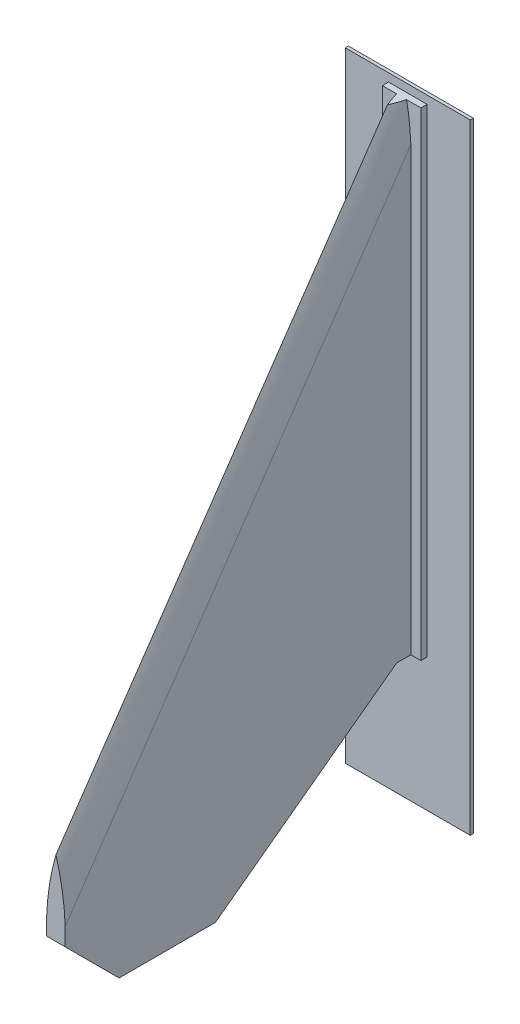
ISO-10303-21;
HEADER;
FILE_DESCRIPTION(('STEP AP214'),'2;1');
FILE_NAME('part.step','',(''),(''),'','','');
FILE_SCHEMA(('AUTOMOTIVE_DESIGN { 1 0 10303 214 1 1 1 1 }'));
ENDSEC;
DATA;
#1=APPLICATION_CONTEXT('core data for automotive mechanical design processes');
#2=APPLICATION_PROTOCOL_DEFINITION('international standard','automotive_design',2000,#1);
#3=PRODUCT_CONTEXT('',#1,'mechanical');
#4=PRODUCT('Part','Part','',(#3));
#5=PRODUCT_RELATED_PRODUCT_CATEGORY('part','',(#4));
#6=PRODUCT_DEFINITION_FORMATION('','',#4);
#7=PRODUCT_DEFINITION_CONTEXT('part definition',#1,'design');
#8=PRODUCT_DEFINITION('design','',#6,#7);
#9=PRODUCT_DEFINITION_SHAPE('','',#8);
#10=(LENGTH_UNIT() NAMED_UNIT(*) SI_UNIT(.MILLI.,.METRE.));
#11=(NAMED_UNIT(*) PLANE_ANGLE_UNIT() SI_UNIT($,.RADIAN.));
#12=(NAMED_UNIT(*) SI_UNIT($,.STERADIAN.) SOLID_ANGLE_UNIT());
#13=UNCERTAINTY_MEASURE_WITH_UNIT(LENGTH_MEASURE(1.E-05),#10,'distance_accuracy_value','');
#14=(GEOMETRIC_REPRESENTATION_CONTEXT(3) GLOBAL_UNCERTAINTY_ASSIGNED_CONTEXT((#13)) GLOBAL_UNIT_ASSIGNED_CONTEXT((#10,
#11,#12)) REPRESENTATION_CONTEXT('',''));
#15=CARTESIAN_POINT('',(0.,0.,0.));
#16=DIRECTION('',(0.,0.,1.));
#17=DIRECTION('',(1.,0.,0.));
#18=AXIS2_PLACEMENT_3D('',#15,#16,#17);
#19=CARTESIAN_POINT('',(-1.524,0.,0.));
#20=DIRECTION('',(0.,-1.,0.));
#21=DIRECTION('',(0.,0.,-1.));
#22=AXIS2_PLACEMENT_3D('',#19,#20,#21);
#23=PLANE('',#22);
#24=DIRECTION('',(0.,0.,-1.));
#25=VECTOR('',#24,1.);
#26=CARTESIAN_POINT('',(-1.524,0.,0.));
#27=LINE('',#26,#25);
#28=CARTESIAN_POINT('',(-1.524,0.,2.33429532514625));
#29=VERTEX_POINT('',#28);
#30=CARTESIAN_POINT('',(-1.524,0.,0.));
#31=VERTEX_POINT('',#30);
#32=EDGE_CURVE('E300',#29,#31,#27,.T.);
#33=ORIENTED_EDGE('',*,*,#32,.T.);
#34=DIRECTION('',(-1.,0.,0.));
#35=VECTOR('',#34,1.);
#36=CARTESIAN_POINT('',(-3.175,0.,0.));
#37=LINE('',#36,#35);
#38=CARTESIAN_POINT('',(-3.175,0.,0.));
#39=VERTEX_POINT('',#38);
#40=EDGE_CURVE('E214',#31,#39,#37,.T.);
#41=ORIENTED_EDGE('',*,*,#40,.T.);
#42=DIRECTION('',(0.,0.,1.));
#43=VECTOR('',#42,1.);
#44=CARTESIAN_POINT('',(-3.175,0.,-1.016));
#45=LINE('',#44,#43);
#46=CARTESIAN_POINT('',(-3.175,0.,-1.016));
#47=VERTEX_POINT('',#46);
#48=EDGE_CURVE('E201',#47,#39,#45,.T.);
#49=ORIENTED_EDGE('',*,*,#48,.F.);
#50=DIRECTION('',(-1.,0.,0.));
#51=VECTOR('',#50,1.);
#52=CARTESIAN_POINT('',(-3.175,0.,-1.016));
#53=LINE('',#52,#51);
#54=CARTESIAN_POINT('',(3.175,0.,-1.016));
#55=VERTEX_POINT('',#54);
#56=EDGE_CURVE('E199',#55,#47,#53,.T.);
#57=ORIENTED_EDGE('',*,*,#56,.F.);
#58=DIRECTION('',(0.,0.,1.));
#59=VECTOR('',#58,1.);
#60=CARTESIAN_POINT('',(3.175,0.,-1.016));
#61=LINE('',#60,#59);
#62=CARTESIAN_POINT('',(3.175,0.,0.));
#63=VERTEX_POINT('',#62);
#64=EDGE_CURVE('E222',#55,#63,#61,.T.);
#65=ORIENTED_EDGE('',*,*,#64,.T.);
#66=CARTESIAN_POINT('',(1.524,0.,0.));
#67=VERTEX_POINT('',#66);
#68=EDGE_CURVE('E193',#63,#67,#37,.T.);
#69=ORIENTED_EDGE('',*,*,#68,.T.);
#70=DIRECTION('',(0.,0.,-1.));
#71=VECTOR('',#70,1.);
#72=CARTESIAN_POINT('',(1.524,0.,0.));
#73=LINE('',#72,#71);
#74=CARTESIAN_POINT('',(1.524,0.,2.33429532514625));
#75=VERTEX_POINT('',#74);
#76=EDGE_CURVE('E295',#75,#67,#73,.T.);
#77=ORIENTED_EDGE('',*,*,#76,.F.);
#78=DIRECTION('',(1.,0.,0.));
#79=VECTOR('',#78,1.);
#80=CARTESIAN_POINT('',(-1.524,0.,2.33429532514625));
#81=LINE('',#80,#79);
#82=EDGE_CURVE('E309',#29,#75,#81,.T.);
#83=ORIENTED_EDGE('',*,*,#82,.F.);
#84=EDGE_LOOP('',(#33,#41,#49,#57,#65,#69,#77,#83));
#85=FACE_BOUND('',#84,.T.);
#86=ADVANCED_FACE('F33',(#85),#23,.T.);
#87=CARTESIAN_POINT('',(-1.524,0.,2.33429532514625));
#88=DIRECTION('',(0.,-0.803895837324771,-0.594770109144622));
#89=DIRECTION('',(0.,0.594770109144622,-0.803895837324771));
#90=AXIS2_PLACEMENT_3D('',#87,#88,#89);
#91=PLANE('',#90);
#92=ORIENTED_EDGE('',*,*,#82,.T.);
#93=DIRECTION('',(0.,0.594770109144622,-0.803895837324771));
#94=VECTOR('',#93,1.);
#95=CARTESIAN_POINT('',(1.524,0.,2.33429532514625));
#96=LINE('',#95,#94);
#97=CARTESIAN_POINT('',(1.524,-22.0564161918037,32.1459164713298));
#98=VERTEX_POINT('',#97);
#99=EDGE_CURVE('E297',#98,#75,#96,.T.);
#100=ORIENTED_EDGE('',*,*,#99,.F.);
#101=DIRECTION('',(1.,0.,0.));
#102=VECTOR('',#101,1.);
#103=CARTESIAN_POINT('',(-1.524,-22.0564161918037,32.1459164713298));
#104=LINE('',#103,#102);
#105=CARTESIAN_POINT('',(-1.524,-22.0564161918037,32.1459164713298));
#106=VERTEX_POINT('',#105);
#107=EDGE_CURVE('E314',#106,#98,#104,.T.);
#108=ORIENTED_EDGE('',*,*,#107,.F.);
#109=DIRECTION('',(0.,0.594770109144622,-0.803895837324771));
#110=VECTOR('',#109,1.);
#111=CARTESIAN_POINT('',(-1.524,0.,2.33429532514625));
#112=LINE('',#111,#110);
#113=EDGE_CURVE('E303',#106,#29,#112,.T.);
#114=ORIENTED_EDGE('',*,*,#113,.T.);
#115=EDGE_LOOP('',(#92,#100,#108,#114));
#116=FACE_BOUND('',#115,.T.);
#117=ADVANCED_FACE('F350',(#116),#91,.T.);
#118=CARTESIAN_POINT('',(-1.524,-22.0564161918037,32.1459164713298));
#119=DIRECTION('',(0.,-1.,0.));
#120=DIRECTION('',(0.,0.,-1.));
#121=AXIS2_PLACEMENT_3D('',#118,#119,#120);
#122=PLANE('',#121);
#123=ORIENTED_EDGE('',*,*,#107,.T.);
#124=DIRECTION('',(0.,0.,-1.));
#125=VECTOR('',#124,1.);
#126=CARTESIAN_POINT('',(1.524,-22.0564161918037,32.1459164713298));
#127=LINE('',#126,#125);
#128=CARTESIAN_POINT('',(1.524,-22.0564161918037,47.9926333712735));
#129=VERTEX_POINT('',#128);
#130=EDGE_CURVE('E328',#129,#98,#127,.T.);
#131=ORIENTED_EDGE('',*,*,#130,.F.);
#132=DIRECTION('',(1.,0.,0.));
#133=VECTOR('',#132,1.);
#134=CARTESIAN_POINT('',(-1.524,-22.0564161918037,47.9926333712735));
#135=LINE('',#134,#133);
#136=CARTESIAN_POINT('',(-1.524,-22.0564161918037,47.9926333712735));
#137=VERTEX_POINT('',#136);
#138=EDGE_CURVE('E312',#137,#129,#135,.T.);
#139=ORIENTED_EDGE('',*,*,#138,.F.);
#140=DIRECTION('',(0.,0.,-1.));
#141=VECTOR('',#140,1.);
#142=CARTESIAN_POINT('',(-1.524,-22.0564161918037,32.1459164713298));
#143=LINE('',#142,#141);
#144=EDGE_CURVE('E319',#137,#106,#143,.T.);
#145=ORIENTED_EDGE('',*,*,#144,.T.);
#146=EDGE_LOOP('',(#123,#131,#139,#145));
#147=FACE_BOUND('',#146,.T.);
#148=ADVANCED_FACE('F346',(#147),#122,.T.);
#149=CARTESIAN_POINT('',(-1.524,-22.0564161918037,47.9926333712735));
#150=DIRECTION('',(0.,-0.707106781186548,0.707106781186546));
#151=DIRECTION('',(0.,-0.707106781186547,-0.707106781186549));
#152=AXIS2_PLACEMENT_3D('',#149,#150,#151);
#153=PLANE('',#152);
#154=ORIENTED_EDGE('',*,*,#138,.T.);
#155=DIRECTION('',(0.,-0.707106781186546,-0.707106781186548));
#156=VECTOR('',#155,1.);
#157=CARTESIAN_POINT('',(1.524,-22.0564161918037,47.9926333712735));
#158=LINE('',#157,#156);
#159=CARTESIAN_POINT('',(1.524,-13.1863749896723,56.8626745734048));
#160=VERTEX_POINT('',#159);
#161=EDGE_CURVE('E331',#160,#129,#158,.T.);
#162=ORIENTED_EDGE('',*,*,#161,.F.);
#163=DIRECTION('',(1.,0.,0.));
#164=VECTOR('',#163,1.);
#165=CARTESIAN_POINT('',(-1.524,-13.1863749896723,56.8626745734048));
#166=LINE('',#165,#164);
#167=CARTESIAN_POINT('',(-1.524,-13.1863749896723,56.8626745734048));
#168=VERTEX_POINT('',#167);
#169=EDGE_CURVE('E302',#168,#160,#166,.T.);
#170=ORIENTED_EDGE('',*,*,#169,.F.);
#171=DIRECTION('',(0.,-0.707106781186546,-0.707106781186548));
#172=VECTOR('',#171,1.);
#173=CARTESIAN_POINT('',(-1.524,-22.0564161918037,47.9926333712735));
#174=LINE('',#173,#172);
#175=EDGE_CURVE('E322',#168,#137,#174,.T.);
#176=ORIENTED_EDGE('',*,*,#175,.T.);
#177=EDGE_LOOP('',(#154,#162,#170,#176));
#178=FACE_BOUND('',#177,.T.);
#179=ADVANCED_FACE('F343',(#178),#153,.T.);
#180=CARTESIAN_POINT('',(-1.524,-13.1863749896723,56.8626745734048));
#181=DIRECTION('',(0.,0.,1.));
#182=DIRECTION('',(1.,0.,0.));
#183=AXIS2_PLACEMENT_3D('',#180,#181,#182);
#184=PLANE('',#183);
#185=CARTESIAN_POINT('',(37.7850881094343,-11.7611214748783,56.8626745734048));
#186=DIRECTION('',(0.,0.,-1.));
#187=DIRECTION('',(1.,0.,0.));
#188=AXIS2_PLACEMENT_3D('',#185,#186,#187);
#189=CIRCLE('',#188,39.3369767411458);
#190=CARTESIAN_POINT('',(-1.524,-10.2801315565557,56.8626745734048));
#191=VERTEX_POINT('',#190);
#192=CARTESIAN_POINT('',(0.,-0.821064084913292,56.8626745734048));
#193=VERTEX_POINT('',#192);
#194=EDGE_CURVE('E229',#191,#193,#189,.T.);
#195=ORIENTED_EDGE('',*,*,#194,.F.);
#196=DIRECTION('',(0.,-1.,0.));
#197=VECTOR('',#196,1.);
#198=CARTESIAN_POINT('',(-1.524,-13.1863749896723,56.8626745734048));
#199=LINE('',#198,#197);
#200=EDGE_CURVE('E306',#191,#168,#199,.T.);
#201=ORIENTED_EDGE('',*,*,#200,.T.);
#202=ORIENTED_EDGE('',*,*,#169,.T.);
#203=DIRECTION('',(0.,-1.,0.));
#204=VECTOR('',#203,1.);
#205=CARTESIAN_POINT('',(1.524,-13.1863749896723,56.8626745734048));
#206=LINE('',#205,#204);
#207=CARTESIAN_POINT('',(1.524,-10.2801315565556,56.8626745734048));
#208=VERTEX_POINT('',#207);
#209=EDGE_CURVE('E292',#208,#160,#206,.T.);
#210=ORIENTED_EDGE('',*,*,#209,.F.);
#211=CARTESIAN_POINT('',(-37.7850881094343,-11.7611214748784,56.8626745734048));
#212=DIRECTION('',(0.,0.,-1.));
#213=DIRECTION('',(-1.,0.,0.));
#214=AXIS2_PLACEMENT_3D('',#211,#212,#213);
#215=CIRCLE('',#214,39.3369767411458);
#216=EDGE_CURVE('E51',#193,#208,#215,.T.);
#217=ORIENTED_EDGE('',*,*,#216,.F.);
#218=EDGE_LOOP('',(#195,#201,#202,#210,#217));
#219=FACE_BOUND('',#218,.T.);
#220=ADVANCED_FACE('F339',(#219),#184,.T.);
#221=CARTESIAN_POINT('',(-1.524,78.74,2.33429532514624));
#222=DIRECTION('',(0.,1.,0.));
#223=DIRECTION('',(0.,0.,1.));
#224=AXIS2_PLACEMENT_3D('',#221,#222,#223);
#225=PLANE('',#224);
#226=CARTESIAN_POINT('',(-1.524,78.74,-4.14861970824375));
#227=CARTESIAN_POINT('',(-1.51371825896039,78.74,-3.96153898447371));
#228=CARTESIAN_POINT('',(-1.50059326464043,78.74,-3.77461545036038));
#229=CARTESIAN_POINT('',(-1.46876603893261,78.74,-3.4020449218006));
#230=CARTESIAN_POINT('',(-1.45008777763733,78.74,-3.21639588000607));
#231=CARTESIAN_POINT('',(-1.40724682935353,78.74,-2.84636210265337));
#232=CARTESIAN_POINT('',(-1.38310271699735,78.74,-2.66197521514452));
#233=CARTESIAN_POINT('',(-1.32941762028496,78.74,-2.29445358205488));
#234=CARTESIAN_POINT('',(-1.29989009187821,78.74,-2.11131686995024));
#235=CARTESIAN_POINT('',(-1.23551653249375,78.74,-1.74628454362839));
#236=CARTESIAN_POINT('',(-1.2006791258625,78.74,-1.56438740775629));
#237=CARTESIAN_POINT('',(-1.125756565645,78.74,-1.20182398286551));
#238=CARTESIAN_POINT('',(-1.08567548204195,78.74,-1.02115685240642));
#239=CARTESIAN_POINT('',(-1.00034139438253,78.74,-0.661097416207776));
#240=CARTESIAN_POINT('',(-0.955089712415739,78.74,-0.481704796989204));
#241=CARTESIAN_POINT('',(-0.859457466656503,78.74,-0.124119290485601));
#242=CARTESIAN_POINT('',(-0.809072319003657,78.74,0.0540723703687956));
#243=CARTESIAN_POINT('',(-0.703218819175915,78.74,0.40927089597473));
#244=CARTESIAN_POINT('',(-0.647741913574638,78.74,0.586275210576693));
#245=CARTESIAN_POINT('',(-0.531743442778314,78.74,0.939112031509249));
#246=CARTESIAN_POINT('',(-0.471209633499148,78.74,1.11494051102723));
#247=CARTESIAN_POINT('',(-0.345128732447443,78.74,1.46543600537005));
#248=CARTESIAN_POINT('',(-0.279565969904735,78.74,1.64009737976876));
#249=CARTESIAN_POINT('',(-0.143452981918217,78.74,1.98826933671841));
#250=CARTESIAN_POINT('',(-0.072883913870658,78.74,2.16177255473749));
#251=CARTESIAN_POINT('',(0.,78.74,2.33429532514619));
#252=B_SPLINE_CURVE_WITH_KNOTS('',3,(#226,#227,#228,#229,#230,#231,#232,#233,#234,#235,#236,
#237,#238,#239,#240,#241,#242,#243,#244,#245,#246,#247,#248,#249,#250,#251),.UNSPECIFIED.,.F.,
.F.,(4,2,2,2,2,2,2,2,2,2,2,2,4),(0.,0.562066140985756,1.12174056007582,1.67954084913324,
2.23596555828684,2.79149596347554,3.34659771295482,3.90155784268212,4.45701793356774,
5.01342882013831,5.57122830239176,6.13084268449768,6.6926882223112),.UNSPECIFIED.);
#253=CARTESIAN_POINT('',(-0.823647122904773,78.74,0.));
#254=VERTEX_POINT('',#253);
#255=CARTESIAN_POINT('',(0.,78.74,2.33429532514619));
#256=VERTEX_POINT('',#255);
#257=EDGE_CURVE('E242',#254,#256,#252,.T.);
#258=ORIENTED_EDGE('',*,*,#257,.T.);
#259=CARTESIAN_POINT('',(0.,78.74,2.33429532514619));
#260=CARTESIAN_POINT('',(0.072883913870665,78.74,2.16177255473749));
#261=CARTESIAN_POINT('',(0.143452981918225,78.74,1.98826933671841));
#262=CARTESIAN_POINT('',(0.279565969904741,78.74,1.64009737976876));
#263=CARTESIAN_POINT('',(0.345128732447446,78.74,1.46543600537005));
#264=CARTESIAN_POINT('',(0.47120963349915,78.74,1.11494051102723));
#265=CARTESIAN_POINT('',(0.531743442778318,78.74,0.939112031509251));
#266=CARTESIAN_POINT('',(0.647741913574645,78.74,0.586275210576697));
#267=CARTESIAN_POINT('',(0.703218819175922,78.74,0.409270895974734));
#268=CARTESIAN_POINT('',(0.809072319003663,78.74,0.0540723703687982));
#269=CARTESIAN_POINT('',(0.859457466656507,78.74,-0.124119290485599));
#270=CARTESIAN_POINT('',(0.955089712415742,78.74,-0.481704796989202));
#271=CARTESIAN_POINT('',(1.00034139438253,78.74,-0.661097416207774));
#272=CARTESIAN_POINT('',(1.08567548204196,78.74,-1.02115685240642));
#273=CARTESIAN_POINT('',(1.125756565645,78.74,-1.20182398286551));
#274=CARTESIAN_POINT('',(1.20067912586251,78.74,-1.56438740775629));
#275=CARTESIAN_POINT('',(1.23551653249376,78.74,-1.74628454362839));
#276=CARTESIAN_POINT('',(1.29989009187822,78.74,-2.11131686995024));
#277=CARTESIAN_POINT('',(1.32941762028497,78.74,-2.29445358205488));
#278=CARTESIAN_POINT('',(1.38310271699735,78.74,-2.66197521514452));
#279=CARTESIAN_POINT('',(1.40724682935353,78.74,-2.84636210265337));
#280=CARTESIAN_POINT('',(1.45008777763733,78.74,-3.21639588000607));
#281=CARTESIAN_POINT('',(1.46876603893261,78.74,-3.4020449218006));
#282=CARTESIAN_POINT('',(1.50059326464044,78.74,-3.77461545036038));
#283=CARTESIAN_POINT('',(1.5137182589604,78.74,-3.96153898447371));
#284=CARTESIAN_POINT('',(1.524,78.74,-4.14861970824375));
#285=B_SPLINE_CURVE_WITH_KNOTS('',3,(#259,#260,#261,#262,#263,#264,#265,#266,#267,#268,#269,
#270,#271,#272,#273,#274,#275,#276,#277,#278,#279,#280,#281,#282,#283,#284),.UNSPECIFIED.,.F.,
.F.,(4,2,2,2,2,2,2,2,2,2,2,2,4),(0.,0.561845537813521,1.12145991991945,1.6792594021729,
2.23567028874347,2.79113037962909,3.34609050935639,3.90119225883566,4.45672266402436,
5.01314737317796,5.57094766223539,6.13062208132545,6.69268822231121),.UNSPECIFIED.);
#286=CARTESIAN_POINT('',(0.823647122904773,78.74,0.));
#287=VERTEX_POINT('',#286);
#288=EDGE_CURVE('E279',#256,#287,#285,.T.);
#289=ORIENTED_EDGE('',*,*,#288,.T.);
#290=DIRECTION('',(1.,0.,0.));
#291=VECTOR('',#290,1.);
#292=CARTESIAN_POINT('',(-3.175,78.74,0.));
#293=LINE('',#292,#291);
#294=CARTESIAN_POINT('',(3.175,78.74,0.));
#295=VERTEX_POINT('',#294);
#296=EDGE_CURVE('E183',#287,#295,#293,.T.);
#297=ORIENTED_EDGE('',*,*,#296,.T.);
#298=DIRECTION('',(0.,0.,1.));
#299=VECTOR('',#298,1.);
#300=CARTESIAN_POINT('',(3.175,78.74,-1.016));
#301=LINE('',#300,#299);
#302=CARTESIAN_POINT('',(3.175,78.74,-1.016));
#303=VERTEX_POINT('',#302);
#304=EDGE_CURVE('E225',#303,#295,#301,.T.);
#305=ORIENTED_EDGE('',*,*,#304,.F.);
#306=DIRECTION('',(1.,0.,0.));
#307=VECTOR('',#306,1.);
#308=CARTESIAN_POINT('',(-3.175,78.74,-1.016));
#309=LINE('',#308,#307);
#310=CARTESIAN_POINT('',(-3.175,78.74,-1.016));
#311=VERTEX_POINT('',#310);
#312=EDGE_CURVE('E192',#311,#303,#309,.T.);
#313=ORIENTED_EDGE('',*,*,#312,.F.);
#314=DIRECTION('',(0.,0.,1.));
#315=VECTOR('',#314,1.);
#316=CARTESIAN_POINT('',(-3.175,78.74,-1.016));
#317=LINE('',#316,#315);
#318=CARTESIAN_POINT('',(-3.175,78.74,0.));
#319=VERTEX_POINT('',#318);
#320=EDGE_CURVE('E227',#311,#319,#317,.T.);
#321=ORIENTED_EDGE('',*,*,#320,.T.);
#322=EDGE_CURVE('E211',#319,#254,#293,.T.);
#323=ORIENTED_EDGE('',*,*,#322,.T.);
#324=EDGE_LOOP('',(#258,#289,#297,#305,#313,#321,#323));
#325=FACE_BOUND('',#324,.T.);
#326=ADVANCED_FACE('F364',(#325),#225,.T.);
#327=CARTESIAN_POINT('',(-1.524,0.,0.));
#328=DIRECTION('',(-1.,0.,0.));
#329=DIRECTION('',(0.,0.,1.));
#330=AXIS2_PLACEMENT_3D('',#327,#328,#329);
#331=PLANE('',#330);
#332=DIRECTION('',(0.,-0.824863155549333,0.565332446103349));
#333=VECTOR('',#332,1.);
#334=CARTESIAN_POINT('',(-1.524,23.2307727461169,33.8954691974434));
#335=LINE('',#334,#333);
#336=CARTESIAN_POINT('',(-1.524,72.6868474394083,0.));
#337=VERTEX_POINT('',#336);
#338=EDGE_CURVE('E11',#337,#191,#335,.T.);
#339=ORIENTED_EDGE('',*,*,#338,.F.);
#340=DIRECTION('',(0.,1.,0.));
#341=VECTOR('',#340,1.);
#342=CARTESIAN_POINT('',(-1.524,78.74,0.));
#343=LINE('',#342,#341);
#344=EDGE_CURVE('E59',#31,#337,#343,.T.);
#345=ORIENTED_EDGE('',*,*,#344,.F.);
#346=ORIENTED_EDGE('',*,*,#32,.F.);
#347=ORIENTED_EDGE('',*,*,#113,.F.);
#348=ORIENTED_EDGE('',*,*,#144,.F.);
#349=ORIENTED_EDGE('',*,*,#175,.F.);
#350=ORIENTED_EDGE('',*,*,#200,.F.);
#351=EDGE_LOOP('',(#339,#345,#346,#347,#348,#349,#350));
#352=FACE_BOUND('',#351,.T.);
#353=ADVANCED_FACE('F348',(#352),#331,.T.);
#354=CARTESIAN_POINT('',(1.524,0.,0.));
#355=DIRECTION('',(-1.,0.,0.));
#356=DIRECTION('',(0.,0.,1.));
#357=AXIS2_PLACEMENT_3D('',#354,#355,#356);
#358=PLANE('',#357);
#359=DIRECTION('',(0.,1.,0.));
#360=VECTOR('',#359,1.);
#361=CARTESIAN_POINT('',(1.524,78.74,0.));
#362=LINE('',#361,#360);
#363=CARTESIAN_POINT('',(1.524,72.6868474394084,0.));
#364=VERTEX_POINT('',#363);
#365=EDGE_CURVE('E289',#67,#364,#362,.T.);
#366=ORIENTED_EDGE('',*,*,#365,.T.);
#367=DIRECTION('',(0.,-0.824863155549333,0.565332446103349));
#368=VECTOR('',#367,1.);
#369=CARTESIAN_POINT('',(1.524,34.496994616392,26.1739935497356));
#370=LINE('',#369,#368);
#371=EDGE_CURVE('E43',#364,#208,#370,.T.);
#372=ORIENTED_EDGE('',*,*,#371,.T.);
#373=ORIENTED_EDGE('',*,*,#209,.T.);
#374=ORIENTED_EDGE('',*,*,#161,.T.);
#375=ORIENTED_EDGE('',*,*,#130,.T.);
#376=ORIENTED_EDGE('',*,*,#99,.T.);
#377=ORIENTED_EDGE('',*,*,#76,.T.);
#378=EDGE_LOOP('',(#366,#372,#373,#374,#375,#376,#377));
#379=FACE_BOUND('',#378,.T.);
#380=ADVANCED_FACE('F257',(#379),#358,.F.);
#381=CARTESIAN_POINT('',(37.7850881094343,84.8934028820467,-9.38096634333169));
#382=DIRECTION('',(0.,0.,-1.));
#383=DIRECTION('',(1.,0.,0.));
#384=AXIS2_PLACEMENT_3D('',#381,#382,#383);
#385=CIRCLE('',#384,39.3369767411458);
#386=DIRECTION('',(0.,-0.824863155549333,0.565332446103349));
#387=VECTOR('',#386,1.);
#388=SURFACE_OF_LINEAR_EXTRUSION('',#385,#387);
#389=CARTESIAN_POINT('',(-0.823647122904773,78.74,0.));
#390=CARTESIAN_POINT('',(-0.862645211680702,78.5401548936583,0.));
#391=CARTESIAN_POINT('',(-0.900091388966516,78.3400069522008,0.));
#392=CARTESIAN_POINT('',(-0.971837007552554,77.9393462925565,0.));
#393=CARTESIAN_POINT('',(-1.00613943701135,77.7388341094509,0.));
#394=CARTESIAN_POINT('',(-1.07160601617764,77.3374463245863,0.));
#395=CARTESIAN_POINT('',(-1.10277240821865,77.1365710885514,0.));
#396=CARTESIAN_POINT('',(-1.16197331124137,76.7344582174829,0.));
#397=CARTESIAN_POINT('',(-1.19000931934349,76.5332208028612,0.));
#398=CARTESIAN_POINT('',(-1.24295355572443,76.1303842127803,0.));
#399=CARTESIAN_POINT('',(-1.26786253513111,75.9287851360404,0.));
#400=CARTESIAN_POINT('',(-1.31455461462513,75.5252253167093,0.));
#401=CARTESIAN_POINT('',(-1.33633771471247,75.323264574118,0.));
#402=CARTESIAN_POINT('',(-1.37677767123561,74.9189812324003,0.));
#403=CARTESIAN_POINT('',(-1.39543377384597,74.7166585578695,0.));
#404=CARTESIAN_POINT('',(-1.42961710495397,74.3116511408115,0.));
#405=CARTESIAN_POINT('',(-1.44514282555466,74.1089662710141,0.));
#406=CARTESIAN_POINT('',(-1.47306044758261,73.7032340524184,0.));
#407=CARTESIAN_POINT('',(-1.48545008240681,73.5001865476579,0.));
#408=CARTESIAN_POINT('',(-1.50708851953441,73.0937284612437,0.));
#409=CARTESIAN_POINT('',(-1.51633429044231,72.8903177182056,0.));
#410=CARTESIAN_POINT('',(-1.524,72.6868474394083,0.));
#411=B_SPLINE_CURVE_WITH_KNOTS('',3,(#389,#390,#391,#392,#393,#394,#395,#396,#397,#398,#399,
#400,#401,#402,#403,#404,#405,#406,#407,#408,#409,#410),.UNSPECIFIED.,.F.,.F.,(4,2,2,2,2,2,2,2,
2,2,4),(0.,0.610837738973069,1.22108871564991,1.83090020207904,2.44041878274993,
3.04979067273565,3.65916256272137,4.26868114339226,4.87849262982137,5.48874360649824,
6.0995813454712),.UNSPECIFIED.);
#412=EDGE_CURVE('E37',#254,#337,#411,.T.);
#413=ORIENTED_EDGE('',*,*,#412,.T.);
#414=ORIENTED_EDGE('',*,*,#338,.T.);
#415=ORIENTED_EDGE('',*,*,#194,.T.);
#416=DIRECTION('',(0.,-0.824863155549333,0.565332446103349));
#417=VECTOR('',#416,1.);
#418=CARTESIAN_POINT('',(0.,95.8334602720117,-9.38096634333169));
#419=LINE('',#418,#417);
#420=EDGE_CURVE('E237',#256,#193,#419,.T.);
#421=ORIENTED_EDGE('',*,*,#420,.F.);
#422=ORIENTED_EDGE('',*,*,#257,.F.);
#423=EDGE_LOOP('',(#413,#414,#415,#421,#422));
#424=FACE_BOUND('',#423,.T.);
#425=ADVANCED_FACE('F251',(#424),#388,.F.);
#426=CARTESIAN_POINT('',(-37.7850881094343,84.8934028820467,-9.38096634333169));
#427=DIRECTION('',(0.,0.,-1.));
#428=DIRECTION('',(-1.,0.,0.));
#429=AXIS2_PLACEMENT_3D('',#426,#427,#428);
#430=CIRCLE('',#429,39.3369767411458);
#431=DIRECTION('',(0.,-0.824863155549333,0.565332446103349));
#432=VECTOR('',#431,1.);
#433=SURFACE_OF_LINEAR_EXTRUSION('',#430,#432);
#434=CARTESIAN_POINT('',(1.524,72.6868474394084,0.));
#435=CARTESIAN_POINT('',(1.51633429044232,72.8903177182057,0.));
#436=CARTESIAN_POINT('',(1.50708851953441,73.0937284612438,0.));
#437=CARTESIAN_POINT('',(1.48545008240681,73.500186547658,0.));
#438=CARTESIAN_POINT('',(1.4730604475826,73.7032340524185,0.));
#439=CARTESIAN_POINT('',(1.44514282555465,74.1089662710142,0.));
#440=CARTESIAN_POINT('',(1.42961710495397,74.3116511408115,0.));
#441=CARTESIAN_POINT('',(1.39543377384597,74.7166585578696,0.));
#442=CARTESIAN_POINT('',(1.3767776712356,74.9189812324004,0.));
#443=CARTESIAN_POINT('',(1.33633771471247,75.323264574118,0.));
#444=CARTESIAN_POINT('',(1.31455461462513,75.5252253167093,0.));
#445=CARTESIAN_POINT('',(1.26786253513111,75.9287851360405,0.));
#446=CARTESIAN_POINT('',(1.24295355572442,76.1303842127803,0.));
#447=CARTESIAN_POINT('',(1.1900093193435,76.5332208028613,0.));
#448=CARTESIAN_POINT('',(1.16197331124138,76.7344582174829,0.));
#449=CARTESIAN_POINT('',(1.10277240821866,77.1365710885514,0.));
#450=CARTESIAN_POINT('',(1.07160601617764,77.3374463245864,0.));
#451=CARTESIAN_POINT('',(1.00613943701135,77.7388341094509,0.));
#452=CARTESIAN_POINT('',(0.971837007552557,77.9393462925565,0.));
#453=CARTESIAN_POINT('',(0.900091388966528,78.3400069522008,0.));
#454=CARTESIAN_POINT('',(0.862645211680718,78.5401548936583,0.));
#455=CARTESIAN_POINT('',(0.82364712290478,78.74,0.));
#456=B_SPLINE_CURVE_WITH_KNOTS('',3,(#434,#435,#436,#437,#438,#439,#440,#441,#442,#443,#444,
#445,#446,#447,#448,#449,#450,#451,#452,#453,#454,#455),.UNSPECIFIED.,.F.,.F.,(4,2,2,2,2,2,2,2,
2,2,4),(0.,0.610837738972964,1.22108871564982,1.83090020207893,2.44041878274981,
3.04979067273551,3.6591625627212,4.26868114339208,4.87849262982119,5.48874360649805,
6.09958134547109),.UNSPECIFIED.);
#457=EDGE_CURVE('E282',#364,#287,#456,.T.);
#458=ORIENTED_EDGE('',*,*,#457,.T.);
#459=ORIENTED_EDGE('',*,*,#288,.F.);
#460=ORIENTED_EDGE('',*,*,#420,.T.);
#461=ORIENTED_EDGE('',*,*,#216,.T.);
#462=ORIENTED_EDGE('',*,*,#371,.F.);
#463=EDGE_LOOP('',(#458,#459,#460,#461,#462));
#464=FACE_BOUND('',#463,.T.);
#465=ADVANCED_FACE('F256',(#464),#433,.F.);
#466=CARTESIAN_POINT('',(-3.175,78.74,0.));
#467=DIRECTION('',(0.,0.,-1.));
#468=DIRECTION('',(-1.,0.,0.));
#469=AXIS2_PLACEMENT_3D('',#466,#467,#468);
#470=PLANE('',#469);
#471=ORIENTED_EDGE('',*,*,#457,.F.);
#472=ORIENTED_EDGE('',*,*,#365,.F.);
#473=ORIENTED_EDGE('',*,*,#68,.F.);
#474=DIRECTION('',(0.,-1.,0.));
#475=VECTOR('',#474,1.);
#476=CARTESIAN_POINT('',(3.175,0.,0.));
#477=LINE('',#476,#475);
#478=EDGE_CURVE('E205',#295,#63,#477,.T.);
#479=ORIENTED_EDGE('',*,*,#478,.F.);
#480=ORIENTED_EDGE('',*,*,#296,.F.);
#481=EDGE_LOOP('',(#471,#472,#473,#479,#480));
#482=FACE_BOUND('',#481,.T.);
#483=ADVANCED_FACE('F361',(#482),#470,.F.);
#484=CARTESIAN_POINT('',(-3.175,0.,-1.016));
#485=DIRECTION('',(1.,0.,0.));
#486=DIRECTION('',(0.,0.,-1.));
#487=AXIS2_PLACEMENT_3D('',#484,#485,#486);
#488=PLANE('',#487);
#489=DIRECTION('',(0.,1.,0.));
#490=VECTOR('',#489,1.);
#491=CARTESIAN_POINT('',(-3.175,0.,0.));
#492=LINE('',#491,#490);
#493=EDGE_CURVE('E180',#39,#319,#492,.T.);
#494=ORIENTED_EDGE('',*,*,#493,.T.);
#495=ORIENTED_EDGE('',*,*,#320,.F.);
#496=DIRECTION('',(0.,1.,0.));
#497=VECTOR('',#496,1.);
#498=CARTESIAN_POINT('',(-3.175,0.,-1.016));
#499=LINE('',#498,#497);
#500=EDGE_CURVE('E189',#47,#311,#499,.T.);
#501=ORIENTED_EDGE('',*,*,#500,.F.);
#502=ORIENTED_EDGE('',*,*,#48,.T.);
#503=EDGE_LOOP('',(#494,#495,#501,#502));
#504=FACE_BOUND('',#503,.T.);
#505=ADVANCED_FACE('F271',(#504),#488,.F.);
#506=CARTESIAN_POINT('',(3.175,0.,-1.016));
#507=DIRECTION('',(-1.,0.,0.));
#508=DIRECTION('',(0.,0.,1.));
#509=AXIS2_PLACEMENT_3D('',#506,#507,#508);
#510=PLANE('',#509);
#511=ORIENTED_EDGE('',*,*,#478,.T.);
#512=ORIENTED_EDGE('',*,*,#64,.F.);
#513=DIRECTION('',(0.,-1.,0.));
#514=VECTOR('',#513,1.);
#515=CARTESIAN_POINT('',(3.175,0.,-1.016));
#516=LINE('',#515,#514);
#517=EDGE_CURVE('E196',#303,#55,#516,.T.);
#518=ORIENTED_EDGE('',*,*,#517,.F.);
#519=ORIENTED_EDGE('',*,*,#304,.T.);
#520=EDGE_LOOP('',(#511,#512,#518,#519));
#521=FACE_BOUND('',#520,.T.);
#522=ADVANCED_FACE('F377',(#521),#510,.F.);
#523=ORIENTED_EDGE('',*,*,#412,.F.);
#524=ORIENTED_EDGE('',*,*,#322,.F.);
#525=ORIENTED_EDGE('',*,*,#493,.F.);
#526=ORIENTED_EDGE('',*,*,#40,.F.);
#527=ORIENTED_EDGE('',*,*,#344,.T.);
#528=EDGE_LOOP('',(#523,#524,#525,#526,#527));
#529=FACE_BOUND('',#528,.T.);
#530=ADVANCED_FACE('F368',(#529),#470,.F.);
#531=CARTESIAN_POINT('',(-10.2774909063559,80.0695104760791,-1.016));
#532=DIRECTION('',(0.,0.,-1.));
#533=DIRECTION('',(-1.,0.,0.));
#534=AXIS2_PLACEMENT_3D('',#531,#532,#533);
#535=PLANE('',#534);
#536=DIRECTION('',(0.,1.,0.));
#537=VECTOR('',#536,1.);
#538=CARTESIAN_POINT('',(-10.2774909063559,-21.8603440719143,-1.016));
#539=LINE('',#538,#537);
#540=CARTESIAN_POINT('',(-10.2774909063559,-21.8603440719143,-1.016));
#541=VERTEX_POINT('',#540);
#542=CARTESIAN_POINT('',(-10.2774909063559,80.0695104760791,-1.016));
#543=VERTEX_POINT('',#542);
#544=EDGE_CURVE('E179',#541,#543,#539,.T.);
#545=ORIENTED_EDGE('',*,*,#544,.F.);
#546=DIRECTION('',(-1.,0.,0.));
#547=VECTOR('',#546,1.);
#548=CARTESIAN_POINT('',(-10.2774909063559,-21.8603440719143,-1.016));
#549=LINE('',#548,#547);
#550=CARTESIAN_POINT('',(10.2774909063559,-21.8603440719143,-1.016));
#551=VERTEX_POINT('',#550);
#552=EDGE_CURVE('E175',#551,#541,#549,.T.);
#553=ORIENTED_EDGE('',*,*,#552,.F.);
#554=DIRECTION('',(0.,-1.,0.));
#555=VECTOR('',#554,1.);
#556=CARTESIAN_POINT('',(10.2774909063559,-21.8603440719143,-1.016));
#557=LINE('',#556,#555);
#558=CARTESIAN_POINT('',(10.2774909063559,80.0695104760791,-1.016));
#559=VERTEX_POINT('',#558);
#560=EDGE_CURVE('E493',#559,#551,#557,.T.);
#561=ORIENTED_EDGE('',*,*,#560,.F.);
#562=DIRECTION('',(1.,0.,0.));
#563=VECTOR('',#562,1.);
#564=CARTESIAN_POINT('',(-10.2774909063559,80.0695104760791,-1.016));
#565=LINE('',#564,#563);
#566=EDGE_CURVE('E496',#543,#559,#565,.T.);
#567=ORIENTED_EDGE('',*,*,#566,.F.);
#568=EDGE_LOOP('',(#545,#553,#561,#567));
#569=FACE_BOUND('',#568,.T.);
#570=ORIENTED_EDGE('',*,*,#56,.T.);
#571=ORIENTED_EDGE('',*,*,#500,.T.);
#572=ORIENTED_EDGE('',*,*,#312,.T.);
#573=ORIENTED_EDGE('',*,*,#517,.T.);
#574=EDGE_LOOP('',(#570,#571,#572,#573));
#575=FACE_BOUND('',#574,.T.);
#576=ADVANCED_FACE('F374',(#569,#575),#535,.F.);
#577=CARTESIAN_POINT('',(-10.2774909063559,-21.8603440719143,-1.524));
#578=DIRECTION('',(1.,0.,0.));
#579=DIRECTION('',(0.,1.,0.));
#580=AXIS2_PLACEMENT_3D('',#577,#578,#579);
#581=PLANE('',#580);
#582=ORIENTED_EDGE('',*,*,#544,.T.);
#583=DIRECTION('',(0.,0.,1.));
#584=VECTOR('',#583,1.);
#585=CARTESIAN_POINT('',(-10.2774909063559,80.0695104760791,-1.524));
#586=LINE('',#585,#584);
#587=CARTESIAN_POINT('',(-10.2774909063559,80.0695104760791,-1.524));
#588=VERTEX_POINT('',#587);
#589=EDGE_CURVE('E159',#588,#543,#586,.T.);
#590=ORIENTED_EDGE('',*,*,#589,.F.);
#591=DIRECTION('',(0.,1.,0.));
#592=VECTOR('',#591,1.);
#593=CARTESIAN_POINT('',(-10.2774909063559,-21.8603440719143,-1.524));
#594=LINE('',#593,#592);
#595=CARTESIAN_POINT('',(-10.2774909063559,-21.8603440719143,-1.524));
#596=VERTEX_POINT('',#595);
#597=EDGE_CURVE('E166',#596,#588,#594,.T.);
#598=ORIENTED_EDGE('',*,*,#597,.F.);
#599=DIRECTION('',(0.,0.,1.));
#600=VECTOR('',#599,1.);
#601=CARTESIAN_POINT('',(-10.2774909063559,-21.8603440719143,-1.524));
#602=LINE('',#601,#600);
#603=EDGE_CURVE('E490',#596,#541,#602,.T.);
#604=ORIENTED_EDGE('',*,*,#603,.T.);
#605=EDGE_LOOP('',(#582,#590,#598,#604));
#606=FACE_BOUND('',#605,.T.);
#607=ADVANCED_FACE('F177',(#606),#581,.F.);
#608=CARTESIAN_POINT('',(-10.2774909063559,80.0695104760791,-1.524));
#609=DIRECTION('',(0.,-1.,0.));
#610=DIRECTION('',(0.,0.,-1.));
#611=AXIS2_PLACEMENT_3D('',#608,#609,#610);
#612=PLANE('',#611);
#613=ORIENTED_EDGE('',*,*,#566,.T.);
#614=DIRECTION('',(0.,0.,1.));
#615=VECTOR('',#614,1.);
#616=CARTESIAN_POINT('',(10.2774909063559,80.0695104760791,-1.524));
#617=LINE('',#616,#615);
#618=CARTESIAN_POINT('',(10.2774909063559,80.0695104760791,-1.524));
#619=VERTEX_POINT('',#618);
#620=EDGE_CURVE('E162',#619,#559,#617,.T.);
#621=ORIENTED_EDGE('',*,*,#620,.F.);
#622=DIRECTION('',(1.,0.,0.));
#623=VECTOR('',#622,1.);
#624=CARTESIAN_POINT('',(-10.2774909063559,80.0695104760791,-1.524));
#625=LINE('',#624,#623);
#626=EDGE_CURVE('E155',#588,#619,#625,.T.);
#627=ORIENTED_EDGE('',*,*,#626,.F.);
#628=ORIENTED_EDGE('',*,*,#589,.T.);
#629=EDGE_LOOP('',(#613,#621,#627,#628));
#630=FACE_BOUND('',#629,.T.);
#631=ADVANCED_FACE('F157',(#630),#612,.F.);
#632=CARTESIAN_POINT('',(10.2774909063559,-21.8603440719143,-1.524));
#633=DIRECTION('',(-1.,0.,0.));
#634=DIRECTION('',(0.,-1.,0.));
#635=AXIS2_PLACEMENT_3D('',#632,#633,#634);
#636=PLANE('',#635);
#637=ORIENTED_EDGE('',*,*,#560,.T.);
#638=DIRECTION('',(0.,0.,1.));
#639=VECTOR('',#638,1.);
#640=CARTESIAN_POINT('',(10.2774909063559,-21.8603440719143,-1.524));
#641=LINE('',#640,#639);
#642=CARTESIAN_POINT('',(10.2774909063559,-21.8603440719143,-1.524));
#643=VERTEX_POINT('',#642);
#644=EDGE_CURVE('E185',#643,#551,#641,.T.);
#645=ORIENTED_EDGE('',*,*,#644,.F.);
#646=DIRECTION('',(0.,-1.,0.));
#647=VECTOR('',#646,1.);
#648=CARTESIAN_POINT('',(10.2774909063559,-21.8603440719143,-1.524));
#649=LINE('',#648,#647);
#650=EDGE_CURVE('E165',#619,#643,#649,.T.);
#651=ORIENTED_EDGE('',*,*,#650,.F.);
#652=ORIENTED_EDGE('',*,*,#620,.T.);
#653=EDGE_LOOP('',(#637,#645,#651,#652));
#654=FACE_BOUND('',#653,.T.);
#655=ADVANCED_FACE('F457',(#654),#636,.F.);
#656=CARTESIAN_POINT('',(-10.2774909063559,-21.8603440719143,-1.524));
#657=DIRECTION('',(0.,1.,0.));
#658=DIRECTION('',(0.,0.,1.));
#659=AXIS2_PLACEMENT_3D('',#656,#657,#658);
#660=PLANE('',#659);
#661=ORIENTED_EDGE('',*,*,#552,.T.);
#662=ORIENTED_EDGE('',*,*,#603,.F.);
#663=DIRECTION('',(-1.,0.,0.));
#664=VECTOR('',#663,1.);
#665=CARTESIAN_POINT('',(-10.2774909063559,-21.8603440719143,-1.524));
#666=LINE('',#665,#664);
#667=EDGE_CURVE('E171',#643,#596,#666,.T.);
#668=ORIENTED_EDGE('',*,*,#667,.F.);
#669=ORIENTED_EDGE('',*,*,#644,.T.);
#670=EDGE_LOOP('',(#661,#662,#668,#669));
#671=FACE_BOUND('',#670,.T.);
#672=ADVANCED_FACE('F466',(#671),#660,.F.);
#673=CARTESIAN_POINT('',(-10.2774909063559,80.0695104760791,-1.524));
#674=DIRECTION('',(0.,0.,-1.));
#675=DIRECTION('',(-1.,0.,0.));
#676=AXIS2_PLACEMENT_3D('',#673,#674,#675);
#677=PLANE('',#676);
#678=ORIENTED_EDGE('',*,*,#597,.T.);
#679=ORIENTED_EDGE('',*,*,#626,.T.);
#680=ORIENTED_EDGE('',*,*,#650,.T.);
#681=ORIENTED_EDGE('',*,*,#667,.T.);
#682=EDGE_LOOP('',(#678,#679,#680,#681));
#683=FACE_BOUND('',#682,.T.);
#684=ADVANCED_FACE('F169',(#683),#677,.T.);
#685=CLOSED_SHELL('',(#86,#117,#148,#179,#220,#326,#353,#380,#425,#465,#483,#505,#522,#530,#576,
#607,#631,#655,#672,#684));
#686=MANIFOLD_SOLID_BREP('B2',#685);
#687=ADVANCED_BREP_SHAPE_REPRESENTATION('',(#18,#686),#14);
#688=SHAPE_DEFINITION_REPRESENTATION(#9,#687);
ENDSEC;
END-ISO-10303-21;
